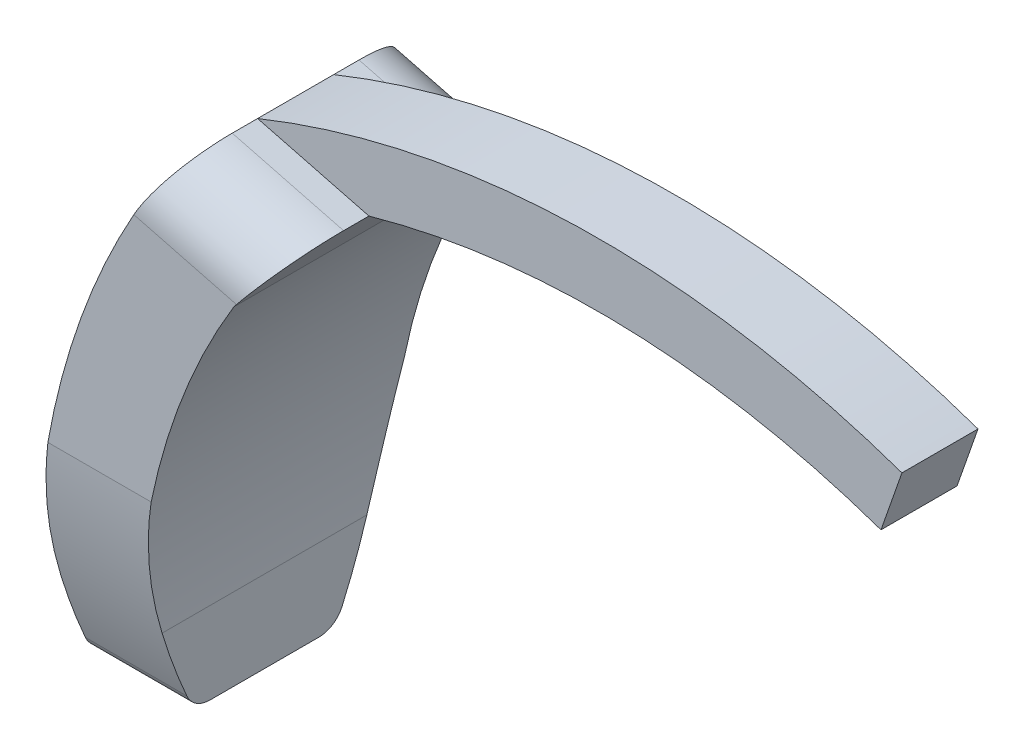
ISO-10303-21;
HEADER;
FILE_DESCRIPTION(('STEP AP214'),'2;1');
FILE_NAME('part.step','',(''),(''),'','','');
FILE_SCHEMA(('AUTOMOTIVE_DESIGN { 1 0 10303 214 1 1 1 1 }'));
ENDSEC;
DATA;
#1=APPLICATION_CONTEXT('core data for automotive mechanical design processes');
#2=APPLICATION_PROTOCOL_DEFINITION('international standard','automotive_design',2000,#1);
#3=PRODUCT_CONTEXT('',#1,'mechanical');
#4=PRODUCT('Part','Part','',(#3));
#5=PRODUCT_RELATED_PRODUCT_CATEGORY('part','',(#4));
#6=PRODUCT_DEFINITION_FORMATION('','',#4);
#7=PRODUCT_DEFINITION_CONTEXT('part definition',#1,'design');
#8=PRODUCT_DEFINITION('design','',#6,#7);
#9=PRODUCT_DEFINITION_SHAPE('','',#8);
#10=(LENGTH_UNIT() NAMED_UNIT(*) SI_UNIT(.MILLI.,.METRE.));
#11=(NAMED_UNIT(*) PLANE_ANGLE_UNIT() SI_UNIT($,.RADIAN.));
#12=(NAMED_UNIT(*) SI_UNIT($,.STERADIAN.) SOLID_ANGLE_UNIT());
#13=UNCERTAINTY_MEASURE_WITH_UNIT(LENGTH_MEASURE(1.E-05),#10,'distance_accuracy_value','');
#14=(GEOMETRIC_REPRESENTATION_CONTEXT(3) GLOBAL_UNCERTAINTY_ASSIGNED_CONTEXT((#13)) GLOBAL_UNIT_ASSIGNED_CONTEXT((#10,
#11,#12)) REPRESENTATION_CONTEXT('',''));
#15=CARTESIAN_POINT('',(0.,0.,0.));
#16=DIRECTION('',(0.,0.,1.));
#17=DIRECTION('',(1.,0.,0.));
#18=AXIS2_PLACEMENT_3D('',#15,#16,#17);
#19=CARTESIAN_POINT('',(37.4689413710405,-26.4802170261831,20.));
#20=DIRECTION('',(0.,0.,-1.));
#21=DIRECTION('',(-1.,0.,0.));
#22=AXIS2_PLACEMENT_3D('',#19,#20,#21);
#23=CYLINDRICAL_SURFACE('',#22,67.0432708850321);
#24=CARTESIAN_POINT('',(37.4689413710405,-26.4802170261831,7.));
#25=DIRECTION('',(0.,0.,1.));
#26=DIRECTION('',(-1.,0.,0.));
#27=AXIS2_PLACEMENT_3D('',#24,#25,#26);
#28=CIRCLE('',#27,67.0432708850321);
#29=CARTESIAN_POINT('',(59.6305427218619,36.7942928220257,7.));
#30=VERTEX_POINT('',#29);
#31=CARTESIAN_POINT('',(19.2412153442252,38.037611322694,7.));
#32=VERTEX_POINT('',#31);
#33=EDGE_CURVE('E178',#30,#32,#28,.T.);
#34=ORIENTED_EDGE('',*,*,#33,.F.);
#35=DIRECTION('',(0.,0.,-1.));
#36=VECTOR('',#35,1.);
#37=CARTESIAN_POINT('',(59.6305427218619,36.7942928220257,20.));
#38=LINE('',#37,#36);
#39=CARTESIAN_POINT('',(59.6305427218619,36.7942928220257,13.));
#40=VERTEX_POINT('',#39);
#41=EDGE_CURVE('E177',#40,#30,#38,.T.);
#42=ORIENTED_EDGE('',*,*,#41,.F.);
#43=CARTESIAN_POINT('',(37.4689413710405,-26.4802170261831,13.));
#44=DIRECTION('',(0.,0.,-1.));
#45=DIRECTION('',(1.,0.,0.));
#46=AXIS2_PLACEMENT_3D('',#43,#44,#45);
#47=CIRCLE('',#46,67.0432708850321);
#48=CARTESIAN_POINT('',(19.2412153442252,38.0376113226939,13.));
#49=VERTEX_POINT('',#48);
#50=EDGE_CURVE('E367',#49,#40,#47,.T.);
#51=ORIENTED_EDGE('',*,*,#50,.F.);
#52=DIRECTION('',(0.,0.,-1.));
#53=VECTOR('',#52,1.);
#54=CARTESIAN_POINT('',(19.2412153442252,38.037611322694,20.));
#55=LINE('',#54,#53);
#56=EDGE_CURVE('E186',#49,#32,#55,.T.);
#57=ORIENTED_EDGE('',*,*,#56,.T.);
#58=EDGE_LOOP('',(#34,#42,#51,#57));
#59=FACE_BOUND('',#58,.T.);
#60=ADVANCED_FACE('F39',(#59),#23,.F.);
#61=CARTESIAN_POINT('',(41.6359563842436,-14.5827991312985,20.));
#62=DIRECTION('',(0.943786140099188,-0.330556684634688,0.));
#63=DIRECTION('',(0.330556684634688,0.943786140099188,0.));
#64=AXIS2_PLACEMENT_3D('',#61,#62,#63);
#65=PLANE('',#64);
#66=ORIENTED_EDGE('',*,*,#41,.T.);
#67=DIRECTION('',(-0.330556684634688,-0.943786140099188,0.));
#68=VECTOR('',#67,1.);
#69=CARTESIAN_POINT('',(61.2833261450353,41.5132235225217,7.));
#70=LINE('',#69,#68);
#71=CARTESIAN_POINT('',(61.2833261450353,41.5132235225217,7.));
#72=VERTEX_POINT('',#71);
#73=EDGE_CURVE('E161',#72,#30,#70,.T.);
#74=ORIENTED_EDGE('',*,*,#73,.F.);
#75=DIRECTION('',(0.,0.,-1.));
#76=VECTOR('',#75,1.);
#77=CARTESIAN_POINT('',(61.2833261450353,41.5132235225217,20.));
#78=LINE('',#77,#76);
#79=CARTESIAN_POINT('',(61.2833261450353,41.5132235225217,13.));
#80=VERTEX_POINT('',#79);
#81=EDGE_CURVE('E175',#80,#72,#78,.T.);
#82=ORIENTED_EDGE('',*,*,#81,.F.);
#83=DIRECTION('',(0.330556684634688,0.943786140099188,0.));
#84=VECTOR('',#83,1.);
#85=CARTESIAN_POINT('',(61.2833261450353,41.5132235225217,13.));
#86=LINE('',#85,#84);
#87=EDGE_CURVE('E370',#40,#80,#86,.T.);
#88=ORIENTED_EDGE('',*,*,#87,.F.);
#89=EDGE_LOOP('',(#66,#74,#82,#88));
#90=FACE_BOUND('',#89,.T.);
#91=ADVANCED_FACE('F173',(#90),#65,.T.);
#92=CARTESIAN_POINT('',(37.4689413710405,-26.4802170261831,20.));
#93=DIRECTION('',(0.,0.,-1.));
#94=DIRECTION('',(-1.,0.,0.));
#95=AXIS2_PLACEMENT_3D('',#92,#93,#94);
#96=CYLINDRICAL_SURFACE('',#95,72.0432708850322);
#97=ORIENTED_EDGE('',*,*,#81,.T.);
#98=CARTESIAN_POINT('',(37.4689413710405,-26.4802170261831,7.));
#99=DIRECTION('',(0.,0.,-1.));
#100=DIRECTION('',(-1.,0.,0.));
#101=AXIS2_PLACEMENT_3D('',#98,#99,#100);
#102=CIRCLE('',#101,72.0432708850322);
#103=CARTESIAN_POINT('',(10.4603294324352,40.3087623114588,7.));
#104=VERTEX_POINT('',#103);
#105=EDGE_CURVE('E158',#104,#72,#102,.T.);
#106=ORIENTED_EDGE('',*,*,#105,.F.);
#107=DIRECTION('',(0.,0.,-1.));
#108=VECTOR('',#107,1.);
#109=CARTESIAN_POINT('',(10.4603294324352,40.3087623114588,20.));
#110=LINE('',#109,#108);
#111=CARTESIAN_POINT('',(10.4603294324352,40.3087623114588,13.));
#112=VERTEX_POINT('',#111);
#113=EDGE_CURVE('E188',#112,#104,#110,.T.);
#114=ORIENTED_EDGE('',*,*,#113,.F.);
#115=CARTESIAN_POINT('',(37.4689413710405,-26.4802170261831,13.));
#116=DIRECTION('',(0.,0.,1.));
#117=DIRECTION('',(1.,0.,0.));
#118=AXIS2_PLACEMENT_3D('',#115,#116,#117);
#119=CIRCLE('',#118,72.0432708850322);
#120=EDGE_CURVE('E183',#80,#112,#119,.T.);
#121=ORIENTED_EDGE('',*,*,#120,.F.);
#122=EDGE_LOOP('',(#97,#106,#114,#121));
#123=FACE_BOUND('',#122,.T.);
#124=ADVANCED_FACE('F181',(#123),#96,.T.);
#125=CARTESIAN_POINT('',(0.,0.,20.));
#126=DIRECTION('',(-1.,0.,0.));
#127=DIRECTION('',(0.,0.,1.));
#128=AXIS2_PLACEMENT_3D('',#125,#126,#127);
#129=PLANE('',#128);
#130=DIRECTION('',(0.,0.,-1.));
#131=VECTOR('',#130,1.);
#132=CARTESIAN_POINT('',(0.,0.,20.));
#133=LINE('',#132,#131);
#134=CARTESIAN_POINT('',(0.,0.,14.2938233166531));
#135=VERTEX_POINT('',#134);
#136=CARTESIAN_POINT('',(0.,0.,5.70617668334694));
#137=VERTEX_POINT('',#136);
#138=EDGE_CURVE('E328',#135,#137,#133,.T.);
#139=ORIENTED_EDGE('',*,*,#138,.F.);
#140=CARTESIAN_POINT('',(0.,2.,14.2938233166531));
#141=DIRECTION('',(-1.,0.,0.));
#142=DIRECTION('',(0.,0.,1.));
#143=AXIS2_PLACEMENT_3D('',#140,#141,#142);
#144=CIRCLE('',#143,2.);
#145=CARTESIAN_POINT('',(0.,1.19470921803027,16.1245354066537));
#146=VERTEX_POINT('',#145);
#147=EDGE_CURVE('E207',#135,#146,#144,.T.);
#148=ORIENTED_EDGE('',*,*,#147,.T.);
#149=CARTESIAN_POINT('',(0.,20.1636842433634,-26.9986850390799));
#150=DIRECTION('',(1.,0.,0.));
#151=DIRECTION('',(0.,0.,1.));
#152=AXIS2_PLACEMENT_3D('',#149,#150,#151);
#153=CIRCLE('',#152,47.1108708805415);
#154=CARTESIAN_POINT('',(0.,6.45878387635238,18.0746980273525));
#155=VERTEX_POINT('',#154);
#156=EDGE_CURVE('E310',#155,#146,#153,.T.);
#157=ORIENTED_EDGE('',*,*,#156,.F.);
#158=DIRECTION('',(0.,0.,-1.));
#159=VECTOR('',#158,1.);
#160=CARTESIAN_POINT('',(0.,6.45878387635238,20.));
#161=LINE('',#160,#159);
#162=CARTESIAN_POINT('',(0.,6.45878387635238,1.92530197264754));
#163=VERTEX_POINT('',#162);
#164=EDGE_CURVE('E320',#155,#163,#161,.T.);
#165=ORIENTED_EDGE('',*,*,#164,.T.);
#166=CARTESIAN_POINT('',(0.,20.1636842433635,46.9986850390799));
#167=DIRECTION('',(1.,0.,0.));
#168=DIRECTION('',(0.,0.,-1.));
#169=AXIS2_PLACEMENT_3D('',#166,#167,#168);
#170=CIRCLE('',#169,47.1108708805415);
#171=CARTESIAN_POINT('',(0.,1.19470921803027,3.87546459334628));
#172=VERTEX_POINT('',#171);
#173=EDGE_CURVE('E311',#172,#163,#170,.T.);
#174=ORIENTED_EDGE('',*,*,#173,.F.);
#175=CARTESIAN_POINT('',(0.,2.,5.70617668334694));
#176=DIRECTION('',(-1.,0.,0.));
#177=DIRECTION('',(0.,0.,1.));
#178=AXIS2_PLACEMENT_3D('',#175,#176,#177);
#179=CIRCLE('',#178,2.);
#180=EDGE_CURVE('E205',#172,#137,#179,.T.);
#181=ORIENTED_EDGE('',*,*,#180,.T.);
#182=EDGE_LOOP('',(#139,#148,#157,#165,#174,#181));
#183=FACE_BOUND('',#182,.T.);
#184=ADVANCED_FACE('F244',(#183),#129,.T.);
#185=CARTESIAN_POINT('',(8.,0.,20.));
#186=DIRECTION('',(-1.,0.,0.));
#187=DIRECTION('',(0.,0.,1.));
#188=AXIS2_PLACEMENT_3D('',#185,#186,#187);
#189=PLANE('',#188);
#190=CARTESIAN_POINT('',(8.,20.1636842433634,-26.9986850390799));
#191=DIRECTION('',(-1.,0.,0.));
#192=DIRECTION('',(0.,0.,1.));
#193=AXIS2_PLACEMENT_3D('',#190,#191,#192);
#194=CIRCLE('',#193,47.1108708805415);
#195=CARTESIAN_POINT('',(8.00000000000001,6.4587838763524,18.0746980273525));
#196=VERTEX_POINT('',#195);
#197=CARTESIAN_POINT('',(8.,1.19470921803027,16.1245354066537));
#198=VERTEX_POINT('',#197);
#199=EDGE_CURVE('E270',#196,#198,#194,.F.);
#200=ORIENTED_EDGE('',*,*,#199,.T.);
#201=CARTESIAN_POINT('',(8.,2.,14.2938233166531));
#202=DIRECTION('',(-1.,0.,0.));
#203=DIRECTION('',(0.,0.,1.));
#204=AXIS2_PLACEMENT_3D('',#201,#202,#203);
#205=CIRCLE('',#204,2.);
#206=CARTESIAN_POINT('',(8.,0.,14.2938233166531));
#207=VERTEX_POINT('',#206);
#208=EDGE_CURVE('E213',#198,#207,#205,.F.);
#209=ORIENTED_EDGE('',*,*,#208,.T.);
#210=DIRECTION('',(0.,0.,-1.));
#211=VECTOR('',#210,1.);
#212=CARTESIAN_POINT('',(8.,0.,20.));
#213=LINE('',#212,#211);
#214=CARTESIAN_POINT('',(8.,0.,5.70617668334694));
#215=VERTEX_POINT('',#214);
#216=EDGE_CURVE('E330',#207,#215,#213,.T.);
#217=ORIENTED_EDGE('',*,*,#216,.T.);
#218=CARTESIAN_POINT('',(8.,2.,5.70617668334694));
#219=DIRECTION('',(-1.,0.,0.));
#220=DIRECTION('',(0.,0.,1.));
#221=AXIS2_PLACEMENT_3D('',#218,#219,#220);
#222=CIRCLE('',#221,2.);
#223=CARTESIAN_POINT('',(8.,1.19470921803027,3.87546459334628));
#224=VERTEX_POINT('',#223);
#225=EDGE_CURVE('E211',#215,#224,#222,.F.);
#226=ORIENTED_EDGE('',*,*,#225,.T.);
#227=CARTESIAN_POINT('',(8.,20.1636842433635,46.9986850390799));
#228=DIRECTION('',(-1.,0.,0.));
#229=DIRECTION('',(0.,0.,1.));
#230=AXIS2_PLACEMENT_3D('',#227,#228,#229);
#231=CIRCLE('',#230,47.1108708805415);
#232=CARTESIAN_POINT('',(8.00000000000001,6.4587838763524,1.92530197264753));
#233=VERTEX_POINT('',#232);
#234=EDGE_CURVE('E309',#224,#233,#231,.F.);
#235=ORIENTED_EDGE('',*,*,#234,.T.);
#236=DIRECTION('',(0.,0.,-1.));
#237=VECTOR('',#236,1.);
#238=CARTESIAN_POINT('',(8.,6.45878387635238,20.));
#239=LINE('',#238,#237);
#240=EDGE_CURVE('E335',#196,#233,#239,.T.);
#241=ORIENTED_EDGE('',*,*,#240,.F.);
#242=EDGE_LOOP('',(#200,#209,#217,#226,#235,#241));
#243=FACE_BOUND('',#242,.T.);
#244=ADVANCED_FACE('F299',(#243),#189,.F.);
#245=CARTESIAN_POINT('',(-6.9296569979171,5.5889955317598,20.));
#246=DIRECTION('',(-0.778382165579646,0.627790732893964,0.));
#247=DIRECTION('',(-0.627790732893964,-0.778382165579646,0.));
#248=AXIS2_PLACEMENT_3D('',#245,#246,#247);
#249=PLANE('',#248);
#250=DIRECTION('',(0.627790732893964,0.778382165579646,0.));
#251=VECTOR('',#250,1.);
#252=CARTESIAN_POINT('',(-6.9296569979171,5.5889955317598,0.));
#253=LINE('',#252,#251);
#254=CARTESIAN_POINT('',(15.5921482682195,33.5132235225216,0.));
#255=VERTEX_POINT('',#254);
#256=CARTESIAN_POINT('',(15.7947945550856,33.7644796296171,0.));
#257=VERTEX_POINT('',#256);
#258=EDGE_CURVE('E269',#255,#257,#253,.T.);
#259=ORIENTED_EDGE('',*,*,#258,.T.);
#260=CARTESIAN_POINT('',(15.7947945550856,33.7644796296171,5.));
#261=DIRECTION('',(-0.778382165579646,0.627790732893964,0.));
#262=DIRECTION('',(-0.627790732893964,-0.778382165579646,0.));
#263=AXIS2_PLACEMENT_3D('',#260,#261,#262);
#264=ELLIPSE('',#263,5.48976053413914,5.);
#265=CARTESIAN_POINT('',(19.2412153442252,38.037611322694,5.));
#266=VERTEX_POINT('',#265);
#267=EDGE_CURVE('E11',#257,#266,#264,.F.);
#268=ORIENTED_EDGE('',*,*,#267,.T.);
#269=DIRECTION('',(0.,0.,-1.));
#270=VECTOR('',#269,1.);
#271=CARTESIAN_POINT('',(19.2412153442252,38.037611322694,7.));
#272=LINE('',#271,#270);
#273=EDGE_CURVE('E375',#32,#266,#272,.T.);
#274=ORIENTED_EDGE('',*,*,#273,.F.);
#275=ORIENTED_EDGE('',*,*,#56,.F.);
#276=CARTESIAN_POINT('',(19.2412153442252,38.037611322694,15.));
#277=VERTEX_POINT('',#276);
#278=EDGE_CURVE('E192',#277,#49,#55,.T.);
#279=ORIENTED_EDGE('',*,*,#278,.F.);
#280=CARTESIAN_POINT('',(15.7947945550856,33.7644796296171,15.));
#281=DIRECTION('',(-0.778382165579646,0.627790732893964,0.));
#282=DIRECTION('',(-0.627790732893964,-0.778382165579646,0.));
#283=AXIS2_PLACEMENT_3D('',#280,#281,#282);
#284=ELLIPSE('',#283,5.48976053413914,5.);
#285=CARTESIAN_POINT('',(15.7947945550856,33.7644796296171,20.));
#286=VERTEX_POINT('',#285);
#287=EDGE_CURVE('E221',#277,#286,#284,.F.);
#288=ORIENTED_EDGE('',*,*,#287,.T.);
#289=DIRECTION('',(0.627790732893964,0.778382165579646,0.));
#290=VECTOR('',#289,1.);
#291=CARTESIAN_POINT('',(-6.9296569979171,5.5889955317598,20.));
#292=LINE('',#291,#290);
#293=CARTESIAN_POINT('',(15.5921482682195,33.5132235225216,20.));
#294=VERTEX_POINT('',#293);
#295=EDGE_CURVE('E271',#294,#286,#292,.T.);
#296=ORIENTED_EDGE('',*,*,#295,.F.);
#297=DIRECTION('',(0.,0.,-1.));
#298=VECTOR('',#297,1.);
#299=CARTESIAN_POINT('',(15.5921482682195,33.5132235225216,20.));
#300=LINE('',#299,#298);
#301=EDGE_CURVE('E338',#294,#255,#300,.T.);
#302=ORIENTED_EDGE('',*,*,#301,.T.);
#303=EDGE_LOOP('',(#259,#268,#274,#275,#279,#288,#296,#302));
#304=FACE_BOUND('',#303,.T.);
#305=ADVANCED_FACE('F243',(#304),#249,.F.);
#306=CARTESIAN_POINT('',(60.,6.45878387635263,20.));
#307=DIRECTION('',(0.,0.,-1.));
#308=DIRECTION('',(-1.,0.,0.));
#309=AXIS2_PLACEMENT_3D('',#306,#307,#308);
#310=CYLINDRICAL_SURFACE('',#309,60.);
#311=DIRECTION('',(0.,0.,-1.));
#312=VECTOR('',#311,1.);
#313=CARTESIAN_POINT('',(10.4603294324352,40.3087623114588,7.));
#314=LINE('',#313,#312);
#315=CARTESIAN_POINT('',(10.4603294324352,40.3087623114588,5.));
#316=VERTEX_POINT('',#315);
#317=EDGE_CURVE('E371',#104,#316,#314,.T.);
#318=ORIENTED_EDGE('',*,*,#317,.T.);
#319=CARTESIAN_POINT('',(10.4603294324352,40.3087623114588,5.));
#320=CARTESIAN_POINT('',(10.4603445998212,40.3087782196875,4.86495757137411));
#321=CARTESIAN_POINT('',(10.4570487142382,40.303960774924,4.7299212038227));
#322=CARTESIAN_POINT('',(10.4439459578353,40.2847761937019,4.46087208782969));
#323=CARTESIAN_POINT('',(10.4341403652017,40.2704109319641,4.32685914366215));
#324=CARTESIAN_POINT('',(10.4081627643769,40.2322968407437,4.06115752563092));
#325=CARTESIAN_POINT('',(10.3920072345433,40.2085722984106,3.92946375031475));
#326=CARTESIAN_POINT('',(10.3535378666817,40.1519578948591,3.66897817575589));
#327=CARTESIAN_POINT('',(10.3312239204178,40.1190678725546,3.54018642756021));
#328=CARTESIAN_POINT('',(10.2807212210798,40.044425789814,3.28644894584309));
#329=CARTESIAN_POINT('',(10.252535190227,40.0026778356336,3.16150146086802));
#330=CARTESIAN_POINT('',(10.190601308443,39.9106429897794,2.91616334020923));
#331=CARTESIAN_POINT('',(10.1568513964505,39.860352933594,2.79577441357802));
#332=CARTESIAN_POINT('',(10.084174746187,39.751645882929,2.56035760498551));
#333=CARTESIAN_POINT('',(10.0452482212881,39.693229223411,2.44532950232299));
#334=CARTESIAN_POINT('',(9.96261417540492,39.5686858207052,2.2212690144221));
#335=CARTESIAN_POINT('',(9.91890484456033,39.5025561582137,2.11223892250562));
#336=CARTESIAN_POINT('',(9.82585131603659,39.3610962980851,1.8978410517902));
#337=CARTESIAN_POINT('',(9.77638289296061,39.2855590935305,1.79266350794159));
#338=CARTESIAN_POINT('',(9.67334701201393,39.127376310896,1.58991698964765));
#339=CARTESIAN_POINT('',(9.61977805556272,39.0447281326588,1.49235082341161));
#340=CARTESIAN_POINT('',(9.45366842434671,38.7869451019204,1.21192172325458));
#341=CARTESIAN_POINT('',(9.33565980838804,38.6018732291354,1.04117951132542));
#342=CARTESIAN_POINT('',(9.08264640652571,38.1996490003785,0.727808661168538));
#343=CARTESIAN_POINT('',(8.94706937482613,37.981308030835,0.587180497672956));
#344=CARTESIAN_POINT('',(8.66888515302981,37.5262527954047,0.349337357806755));
#345=CARTESIAN_POINT('',(8.52627928812825,37.2895419881142,0.252114232482172));
#346=CARTESIAN_POINT('',(8.26833645234535,36.8542623490092,0.118920702881748));
#347=CARTESIAN_POINT('',(8.15348744073729,36.6579825749621,0.0744223802878542));
#348=CARTESIAN_POINT('',(7.98159930736684,36.3602746072848,0.0298296197724729));
#349=CARTESIAN_POINT('',(7.92438262886311,36.2605174802787,0.0186578483386883));
#350=CARTESIAN_POINT('',(7.81027743434646,36.0602394787038,0.00374208086389099));
#351=CARTESIAN_POINT('',(7.75338897915929,35.9597184700958,-5.79889697235349E-07));
#352=CARTESIAN_POINT('',(7.69677995737001,35.8590079090404,0.));
#353=B_SPLINE_CURVE_WITH_KNOTS('',3,(#319,#320,#321,#322,#323,#324,#325,#326,#327,#328,#329,
#330,#331,#332,#333,#334,#335,#336,#337,#338,#339,#340,#341,#342,#343,#344,#345,#346,#347,#348,
#349,#350,#351,#352),.UNSPECIFIED.,.F.,.F.,(4,2,2,2,2,2,2,2,2,2,2,2,2,2,2,2,4),(0.,
0.404991915471956,0.809904333967831,1.21377285232145,1.61764846923163,2.02133726969629,
2.42517594840883,2.82899798666431,3.23297336704454,3.6483512517675,4.06388167194553,
4.89437936048958,5.76944631197044,6.64434890736727,7.33753990425988,7.68395156327089,
8.03042547970179),.UNSPECIFIED.);
#354=CARTESIAN_POINT('',(7.69677995737001,35.8590079090404,0.));
#355=VERTEX_POINT('',#354);
#356=EDGE_CURVE('E62',#316,#355,#353,.T.);
#357=ORIENTED_EDGE('',*,*,#356,.T.);
#358=CARTESIAN_POINT('',(60.,6.45878387635263,0.));
#359=DIRECTION('',(0.,0.,1.));
#360=DIRECTION('',(1.,0.,0.));
#361=AXIS2_PLACEMENT_3D('',#358,#359,#360);
#362=CIRCLE('',#361,60.);
#363=CARTESIAN_POINT('',(0.918024685161334,16.914413598985,0.));
#364=VERTEX_POINT('',#363);
#365=EDGE_CURVE('E321',#355,#364,#362,.T.);
#366=ORIENTED_EDGE('',*,*,#365,.T.);
#367=CARTESIAN_POINT('',(0.918024685161334,16.914413598985,0.));
#368=CARTESIAN_POINT('',(0.840255060275895,16.4749781622404,0.030377695300604));
#369=CARTESIAN_POINT('',(0.767475504660092,16.0351246393843,0.0669833507821966));
#370=CARTESIAN_POINT('',(0.631892217911945,15.1551009220275,0.15272819585631));
#371=CARTESIAN_POINT('',(0.569088513326063,14.7149307266873,0.201867418800654));
#372=CARTESIAN_POINT('',(0.396240135044911,13.3993315820688,0.367621544043428));
#373=CARTESIAN_POINT('',(0.300945254734914,12.5242061110229,0.502889762155534));
#374=CARTESIAN_POINT('',(0.149387748907843,10.7797527887144,0.82334054462956));
#375=CARTESIAN_POINT('',(0.0931246795628952,9.91042487163963,1.0085225413923));
#376=CARTESIAN_POINT('',(0.0370760638841769,8.61212876235278,1.32379471859797));
#377=CARTESIAN_POINT('',(0.0231184768566493,8.17919026722277,1.43547623928244));
#378=CARTESIAN_POINT('',(0.00457910103329028,7.3164875562469,1.67116956353693));
#379=CARTESIAN_POINT('',(-2.84511534188695E-06,6.88672328724813,1.79518116013281));
#380=CARTESIAN_POINT('',(0.,6.45878387635236,1.92530197264754));
#381=B_SPLINE_CURVE_WITH_KNOTS('',3,(#367,#368,#369,#370,#371,#372,#373,#374,#375,#376,#377,
#378,#379,#380),.UNSPECIFIED.,.F.,.F.,(4,2,2,2,2,2,4),(0.,1.34175037124948,2.68350431293408,
5.3529756985889,8.02241672938191,9.36415942494602,10.7058796016546),.UNSPECIFIED.);
#382=EDGE_CURVE('E250',#364,#163,#381,.T.);
#383=ORIENTED_EDGE('',*,*,#382,.T.);
#384=ORIENTED_EDGE('',*,*,#164,.F.);
#385=CARTESIAN_POINT('',(0.,6.45878387635236,18.0746980273525));
#386=CARTESIAN_POINT('',(-2.84511534116452E-06,6.88672328724813,18.2048188398672));
#387=CARTESIAN_POINT('',(0.00457910103329138,7.31648755624689,18.3288304364631));
#388=CARTESIAN_POINT('',(0.0231184768566508,8.17919026722276,18.5645237607176));
#389=CARTESIAN_POINT('',(0.0370760638841785,8.61212876235277,18.676205281402));
#390=CARTESIAN_POINT('',(0.0931246795628967,9.91042487163961,18.9914774586077));
#391=CARTESIAN_POINT('',(0.149387748907844,10.7797527887144,19.1766594553704));
#392=CARTESIAN_POINT('',(0.300945254734912,12.5242061110228,19.4971102378445));
#393=CARTESIAN_POINT('',(0.396240135044907,13.3993315820687,19.6323784559566));
#394=CARTESIAN_POINT('',(0.569088513326056,14.7149307266872,19.7981325811993));
#395=CARTESIAN_POINT('',(0.631892217911937,15.1551009220274,19.8472718041437));
#396=CARTESIAN_POINT('',(0.767475504660081,16.0351246393842,19.9330166492178));
#397=CARTESIAN_POINT('',(0.840255060275882,16.4749781622404,19.9696223046994));
#398=CARTESIAN_POINT('',(0.918024685161319,16.914413598985,20.));
#399=B_SPLINE_CURVE_WITH_KNOTS('',3,(#385,#386,#387,#388,#389,#390,#391,#392,#393,#394,#395,
#396,#397,#398),.UNSPECIFIED.,.F.,.F.,(4,2,2,2,2,2,4),(0.,1.34172017670854,2.68346287227264,
5.35290390306563,8.02237528872045,9.36412923040504,10.7058796016545),.UNSPECIFIED.);
#400=CARTESIAN_POINT('',(0.918024685161327,16.914413598985,20.));
#401=VERTEX_POINT('',#400);
#402=EDGE_CURVE('E260',#155,#401,#399,.T.);
#403=ORIENTED_EDGE('',*,*,#402,.T.);
#404=CARTESIAN_POINT('',(60.,6.45878387635263,20.));
#405=DIRECTION('',(0.,0.,1.));
#406=DIRECTION('',(1.,0.,0.));
#407=AXIS2_PLACEMENT_3D('',#404,#405,#406);
#408=CIRCLE('',#407,60.);
#409=CARTESIAN_POINT('',(7.69677995737001,35.8590079090404,20.));
#410=VERTEX_POINT('',#409);
#411=EDGE_CURVE('E347',#410,#401,#408,.T.);
#412=ORIENTED_EDGE('',*,*,#411,.F.);
#413=CARTESIAN_POINT('',(7.69677995737002,35.8590079090404,20.));
#414=CARTESIAN_POINT('',(7.77081530243654,35.9907289959482,20.0000122223199));
#415=CARTESIAN_POINT('',(7.84535425252816,36.1221582278871,19.9936003017493));
#416=CARTESIAN_POINT('',(7.99487403797245,36.3835120072653,19.9680967782982));
#417=CARTESIAN_POINT('',(8.06985483260224,36.5134366901982,19.949006326372));
#418=CARTESIAN_POINT('',(8.21968625772511,36.7708496474946,19.8983211749047));
#419=CARTESIAN_POINT('',(8.29453691806058,36.8983385745554,19.866729875849));
#420=CARTESIAN_POINT('',(8.44355031883548,37.1500509663868,19.7912898092601));
#421=CARTESIAN_POINT('',(8.51771305445718,37.2742744082996,19.7474409559509));
#422=CARTESIAN_POINT('',(8.66476458568018,37.5186284609157,19.6477808855076));
#423=CARTESIAN_POINT('',(8.73765325229793,37.6387586583847,19.5919684647112));
#424=CARTESIAN_POINT('',(8.88156751261972,37.874144729022,19.4687186713698));
#425=CARTESIAN_POINT('',(8.95259240821085,37.9893987853581,19.4012770124999));
#426=CARTESIAN_POINT('',(9.09209443923044,38.2141399259426,19.2552339731469));
#427=CARTESIAN_POINT('',(9.16057280446923,38.3236298048235,19.1766380701484));
#428=CARTESIAN_POINT('',(9.29440767244893,38.5361697674005,19.0087090245071));
#429=CARTESIAN_POINT('',(9.35976310827075,38.6392176539058,18.9193722484833));
#430=CARTESIAN_POINT('',(9.48635549415256,38.8375653863507,18.7310163623249));
#431=CARTESIAN_POINT('',(9.54761199024316,38.9329025359597,18.632049698773));
#432=CARTESIAN_POINT('',(9.6657344969587,39.1156906477469,18.4246666137749));
#433=CARTESIAN_POINT('',(9.72260070089813,39.2031419571852,18.3162506088525));
#434=CARTESIAN_POINT('',(9.83132866198454,39.3694857193176,18.0906290170421));
#435=CARTESIAN_POINT('',(9.88318889355431,39.4483755637977,17.9734207699237));
#436=CARTESIAN_POINT('',(9.98124499791076,39.5968596218718,17.7310888027432));
#437=CARTESIAN_POINT('',(10.0274433575035,39.6664579177061,17.6059685946434));
#438=CARTESIAN_POINT('',(10.1118811943629,39.7931680274261,17.3538344871025));
#439=CARTESIAN_POINT('',(10.1503656625546,39.8506688409051,17.2270980760591));
#440=CARTESIAN_POINT('',(10.2210990727083,39.9560232968974,16.9680647521764));
#441=CARTESIAN_POINT('',(10.2533508627292,40.0038813461566,16.8357704128704));
#442=CARTESIAN_POINT('',(10.3111848047098,40.0894888428302,16.5666772324342));
#443=CARTESIAN_POINT('',(10.3367733778077,40.1272480231739,16.4298828721299));
#444=CARTESIAN_POINT('',(10.3809601753398,40.1923343076495,16.152786063508));
#445=CARTESIAN_POINT('',(10.3995612260632,40.2196656296763,16.0124850580897));
#446=CARTESIAN_POINT('',(10.4297322175692,40.2639510126163,15.7273848199493));
#447=CARTESIAN_POINT('',(10.441195662576,40.2807479216846,15.58254982625));
#448=CARTESIAN_POINT('',(10.4564996272704,40.3031571158489,15.2918114002364));
#449=CARTESIAN_POINT('',(10.4603501654901,40.3087841005265,15.1459096260838));
#450=CARTESIAN_POINT('',(10.4603294324352,40.3087623114588,15.));
#451=B_SPLINE_CURVE_WITH_KNOTS('',3,(#413,#414,#415,#416,#417,#418,#419,#420,#421,#422,#423,
#424,#425,#426,#427,#428,#429,#430,#431,#432,#433,#434,#435,#436,#437,#438,#439,#440,#441,#442,
#443,#444,#445,#446,#447,#448,#449,#450),.UNSPECIFIED.,.F.,.F.,(4,2,2,2,2,2,2,2,2,2,2,2,2,2,2,2,
2,2,4),(0.,0.453156724908615,0.906272317962791,1.3592647389662,1.81226033000256,
2.26530151862636,2.71851004829568,3.17149678724764,3.62463719423184,4.07543482080602,
4.52621258640715,4.97712729630968,5.42784324032697,5.86047199631319,6.29290259014736,
6.72491490863355,7.15675229961618,7.5948874790581,8.032445690866),.UNSPECIFIED.);
#452=CARTESIAN_POINT('',(10.4603294324352,40.3087623114588,15.));
#453=VERTEX_POINT('',#452);
#454=EDGE_CURVE('E225',#410,#453,#451,.T.);
#455=ORIENTED_EDGE('',*,*,#454,.T.);
#456=EDGE_CURVE('E184',#453,#112,#110,.T.);
#457=ORIENTED_EDGE('',*,*,#456,.T.);
#458=ORIENTED_EDGE('',*,*,#113,.T.);
#459=EDGE_LOOP('',(#318,#357,#366,#383,#384,#403,#412,#455,#457,#458));
#460=FACE_BOUND('',#459,.T.);
#461=ADVANCED_FACE('F237',(#460),#310,.T.);
#462=CARTESIAN_POINT('',(0.,0.,20.));
#463=DIRECTION('',(0.,1.,0.));
#464=DIRECTION('',(0.,0.,1.));
#465=AXIS2_PLACEMENT_3D('',#462,#463,#464);
#466=PLANE('',#465);
#467=ORIENTED_EDGE('',*,*,#216,.F.);
#468=DIRECTION('',(-1.,0.,0.));
#469=VECTOR('',#468,1.);
#470=CARTESIAN_POINT('',(0.,0.,14.2938233166531));
#471=LINE('',#470,#469);
#472=EDGE_CURVE('E202',#207,#135,#471,.T.);
#473=ORIENTED_EDGE('',*,*,#472,.T.);
#474=ORIENTED_EDGE('',*,*,#138,.T.);
#475=DIRECTION('',(-1.,0.,0.));
#476=VECTOR('',#475,1.);
#477=CARTESIAN_POINT('',(0.,0.,5.70617668334694));
#478=LINE('',#477,#476);
#479=EDGE_CURVE('E200',#137,#215,#478,.F.);
#480=ORIENTED_EDGE('',*,*,#479,.T.);
#481=EDGE_LOOP('',(#467,#473,#474,#480));
#482=FACE_BOUND('',#481,.T.);
#483=ADVANCED_FACE('F242',(#482),#466,.F.);
#484=CARTESIAN_POINT('',(60.,6.45878387635263,20.));
#485=DIRECTION('',(0.,0.,-1.));
#486=DIRECTION('',(-1.,0.,0.));
#487=AXIS2_PLACEMENT_3D('',#484,#485,#486);
#488=CYLINDRICAL_SURFACE('',#487,52.);
#489=CARTESIAN_POINT('',(8.00000000000001,6.4587838763524,18.0746980273525));
#490=CARTESIAN_POINT('',(7.99999670018985,6.88757601345745,18.2050789550254));
#491=CARTESIAN_POINT('',(8.00530473246985,7.31819798619936,18.3293237502157));
#492=CARTESIAN_POINT('',(8.02678150059162,8.1825668069258,18.5654200733919));
#493=CARTESIAN_POINT('',(8.04295048245074,8.61631372547503,18.6772713205778));
#494=CARTESIAN_POINT('',(8.1078498725146,9.91628850822193,18.992801596996));
#495=CARTESIAN_POINT('',(8.17296785296353,10.786311925667,19.1779942915785));
#496=CARTESIAN_POINT('',(8.34831844008648,12.5310543613196,19.4982372957678));
#497=CARTESIAN_POINT('',(8.45855173099638,13.4057734505448,19.6332868448254));
#498=CARTESIAN_POINT('',(8.65844737423739,14.7197162839589,19.7986863843312));
#499=CARTESIAN_POINT('',(8.73110120318003,15.159299856179,19.8477123847838));
#500=CARTESIAN_POINT('',(8.88791967992399,16.0376309889704,19.933229149953));
#501=CARTESIAN_POINT('',(8.97208428475702,16.4763785526563,19.9697199614601));
#502=CARTESIAN_POINT('',(9.06200036217357,16.914413598985,20.));
#503=B_SPLINE_CURVE_WITH_KNOTS('',3,(#489,#490,#491,#492,#493,#494,#495,#496,#497,#498,#499,
#500,#501,#502),.UNSPECIFIED.,.F.,.F.,(4,2,2,2,2,2,4),(0.,1.34437952162072,2.68878949654913,
5.36178095381603,8.03481295218575,9.37923798207002,10.7236579935202),.UNSPECIFIED.);
#504=CARTESIAN_POINT('',(9.06200036217357,16.914413598985,20.));
#505=VERTEX_POINT('',#504);
#506=EDGE_CURVE('E285',#196,#505,#503,.T.);
#507=ORIENTED_EDGE('',*,*,#506,.F.);
#508=ORIENTED_EDGE('',*,*,#240,.T.);
#509=CARTESIAN_POINT('',(9.06200036217357,16.914413598985,0.));
#510=CARTESIAN_POINT('',(8.97208428475703,16.4763785526563,0.0302800385399477));
#511=CARTESIAN_POINT('',(8.887919679924,16.0376309889705,0.0667708500469962));
#512=CARTESIAN_POINT('',(8.73110120318004,15.1592998561791,0.152287615216177));
#513=CARTESIAN_POINT('',(8.6584473742374,14.719716283959,0.201313615668822));
#514=CARTESIAN_POINT('',(8.45855173099637,13.4057734505449,0.366713155174588));
#515=CARTESIAN_POINT('',(8.34831844008647,12.5310543613196,0.501762704232202));
#516=CARTESIAN_POINT('',(8.17296785296352,10.7863119256671,0.822005708421512));
#517=CARTESIAN_POINT('',(8.1078498725146,9.91628850822195,1.00719840300403));
#518=CARTESIAN_POINT('',(8.04295048245074,8.61631372547505,1.32272867942218));
#519=CARTESIAN_POINT('',(8.02678150059162,8.18256680692582,1.43457992660811));
#520=CARTESIAN_POINT('',(8.00530473246985,7.31819798619937,1.6706762497843));
#521=CARTESIAN_POINT('',(7.99999670018985,6.88757601345745,1.79492104497461));
#522=CARTESIAN_POINT('',(8.,6.4587838763524,1.92530197264753));
#523=B_SPLINE_CURVE_WITH_KNOTS('',3,(#509,#510,#511,#512,#513,#514,#515,#516,#517,#518,#519,
#520,#521,#522),.UNSPECIFIED.,.F.,.F.,(4,2,2,2,2,2,4),(0.,1.34442001145019,2.68884504133448,
5.36187703970421,8.03486849697113,9.37927847189953,10.7236579935203),.UNSPECIFIED.);
#524=CARTESIAN_POINT('',(9.06200036217357,16.914413598985,0.));
#525=VERTEX_POINT('',#524);
#526=EDGE_CURVE('E302',#525,#233,#523,.T.);
#527=ORIENTED_EDGE('',*,*,#526,.F.);
#528=CARTESIAN_POINT('',(60.,6.45878387635263,0.));
#529=DIRECTION('',(0.,0.,1.));
#530=DIRECTION('',(1.,0.,0.));
#531=AXIS2_PLACEMENT_3D('',#528,#529,#530);
#532=CIRCLE('',#531,52.);
#533=EDGE_CURVE('E341',#255,#525,#532,.T.);
#534=ORIENTED_EDGE('',*,*,#533,.F.);
#535=ORIENTED_EDGE('',*,*,#301,.F.);
#536=CARTESIAN_POINT('',(60.,6.45878387635263,20.));
#537=DIRECTION('',(0.,0.,1.));
#538=DIRECTION('',(1.,0.,0.));
#539=AXIS2_PLACEMENT_3D('',#536,#537,#538);
#540=CIRCLE('',#539,52.);
#541=EDGE_CURVE('E340',#294,#505,#540,.T.);
#542=ORIENTED_EDGE('',*,*,#541,.T.);
#543=EDGE_LOOP('',(#507,#508,#527,#534,#535,#542));
#544=FACE_BOUND('',#543,.T.);
#545=ADVANCED_FACE('F291',(#544),#488,.F.);
#546=CARTESIAN_POINT('',(0.,0.,20.));
#547=DIRECTION('',(0.,0.,1.));
#548=DIRECTION('',(1.,0.,0.));
#549=AXIS2_PLACEMENT_3D('',#546,#547,#548);
#550=PLANE('',#549);
#551=ORIENTED_EDGE('',*,*,#295,.T.);
#552=DIRECTION('',(0.968140704872082,-0.250406820134333,0.));
#553=VECTOR('',#552,1.);
#554=CARTESIAN_POINT('',(9.20829533176352,35.4680587870984,20.));
#555=LINE('',#554,#553);
#556=EDGE_CURVE('E223',#286,#410,#555,.F.);
#557=ORIENTED_EDGE('',*,*,#556,.T.);
#558=ORIENTED_EDGE('',*,*,#411,.T.);
#559=DIRECTION('',(-1.,0.,0.));
#560=VECTOR('',#559,1.);
#561=CARTESIAN_POINT('',(15.,16.914413598985,20.));
#562=LINE('',#561,#560);
#563=EDGE_CURVE('E197',#505,#401,#562,.T.);
#564=ORIENTED_EDGE('',*,*,#563,.F.);
#565=ORIENTED_EDGE('',*,*,#541,.F.);
#566=EDGE_LOOP('',(#551,#557,#558,#564,#565));
#567=FACE_BOUND('',#566,.T.);
#568=ADVANCED_FACE('F296',(#567),#550,.T.);
#569=CARTESIAN_POINT('',(0.,0.,0.));
#570=DIRECTION('',(0.,0.,1.));
#571=DIRECTION('',(1.,0.,0.));
#572=AXIS2_PLACEMENT_3D('',#569,#570,#571);
#573=PLANE('',#572);
#574=ORIENTED_EDGE('',*,*,#365,.F.);
#575=DIRECTION('',(-0.968140704872082,0.250406820134333,0.));
#576=VECTOR('',#575,1.);
#577=CARTESIAN_POINT('',(9.17588031968439,35.4764428371218,0.));
#578=LINE('',#577,#576);
#579=EDGE_CURVE('E48',#355,#257,#578,.F.);
#580=ORIENTED_EDGE('',*,*,#579,.T.);
#581=ORIENTED_EDGE('',*,*,#258,.F.);
#582=ORIENTED_EDGE('',*,*,#533,.T.);
#583=DIRECTION('',(-1.,0.,0.));
#584=VECTOR('',#583,1.);
#585=CARTESIAN_POINT('',(15.,16.914413598985,0.));
#586=LINE('',#585,#584);
#587=EDGE_CURVE('E194',#525,#364,#586,.T.);
#588=ORIENTED_EDGE('',*,*,#587,.T.);
#589=EDGE_LOOP('',(#574,#580,#581,#582,#588));
#590=FACE_BOUND('',#589,.T.);
#591=ADVANCED_FACE('F298',(#590),#573,.F.);
#592=CARTESIAN_POINT('',(15.,20.1636842433635,46.9986850390799));
#593=DIRECTION('',(-1.,0.,0.));
#594=DIRECTION('',(0.,0.,1.));
#595=AXIS2_PLACEMENT_3D('',#592,#593,#594);
#596=CYLINDRICAL_SURFACE('',#595,47.1108708805415);
#597=ORIENTED_EDGE('',*,*,#234,.F.);
#598=DIRECTION('',(-1.,0.,0.));
#599=VECTOR('',#598,1.);
#600=CARTESIAN_POINT('',(15.,1.19470921803026,3.87546459334628));
#601=LINE('',#600,#599);
#602=EDGE_CURVE('E215',#224,#172,#601,.T.);
#603=ORIENTED_EDGE('',*,*,#602,.T.);
#604=ORIENTED_EDGE('',*,*,#173,.T.);
#605=ORIENTED_EDGE('',*,*,#382,.F.);
#606=ORIENTED_EDGE('',*,*,#587,.F.);
#607=ORIENTED_EDGE('',*,*,#526,.T.);
#608=EDGE_LOOP('',(#597,#603,#604,#605,#606,#607));
#609=FACE_BOUND('',#608,.T.);
#610=ADVANCED_FACE('F278',(#609),#596,.T.);
#611=CARTESIAN_POINT('',(15.,20.1636842433634,-26.9986850390799));
#612=DIRECTION('',(-1.,0.,0.));
#613=DIRECTION('',(0.,0.,1.));
#614=AXIS2_PLACEMENT_3D('',#611,#612,#613);
#615=CYLINDRICAL_SURFACE('',#614,47.1108708805415);
#616=ORIENTED_EDGE('',*,*,#156,.T.);
#617=DIRECTION('',(-1.,0.,0.));
#618=VECTOR('',#617,1.);
#619=CARTESIAN_POINT('',(15.,1.19470921803027,16.1245354066537));
#620=LINE('',#619,#618);
#621=EDGE_CURVE('E209',#146,#198,#620,.F.);
#622=ORIENTED_EDGE('',*,*,#621,.T.);
#623=ORIENTED_EDGE('',*,*,#199,.F.);
#624=ORIENTED_EDGE('',*,*,#506,.T.);
#625=ORIENTED_EDGE('',*,*,#563,.T.);
#626=ORIENTED_EDGE('',*,*,#402,.F.);
#627=EDGE_LOOP('',(#616,#622,#623,#624,#625,#626));
#628=FACE_BOUND('',#627,.T.);
#629=ADVANCED_FACE('F273',(#628),#615,.T.);
#630=CARTESIAN_POINT('',(15.,2.,14.2938233166531));
#631=DIRECTION('',(-1.,0.,0.));
#632=DIRECTION('',(0.,0.,1.));
#633=AXIS2_PLACEMENT_3D('',#630,#631,#632);
#634=CYLINDRICAL_SURFACE('',#633,2.);
#635=ORIENTED_EDGE('',*,*,#208,.F.);
#636=ORIENTED_EDGE('',*,*,#621,.F.);
#637=ORIENTED_EDGE('',*,*,#147,.F.);
#638=ORIENTED_EDGE('',*,*,#472,.F.);
#639=EDGE_LOOP('',(#635,#636,#637,#638));
#640=FACE_BOUND('',#639,.T.);
#641=ADVANCED_FACE('F277',(#640),#634,.T.);
#642=CARTESIAN_POINT('',(15.,2.,5.70617668334694));
#643=DIRECTION('',(-1.,0.,0.));
#644=DIRECTION('',(0.,0.,1.));
#645=AXIS2_PLACEMENT_3D('',#642,#643,#644);
#646=CYLINDRICAL_SURFACE('',#645,2.);
#647=ORIENTED_EDGE('',*,*,#225,.F.);
#648=ORIENTED_EDGE('',*,*,#479,.F.);
#649=ORIENTED_EDGE('',*,*,#180,.F.);
#650=ORIENTED_EDGE('',*,*,#602,.F.);
#651=EDGE_LOOP('',(#647,#648,#649,#650));
#652=FACE_BOUND('',#651,.T.);
#653=ADVANCED_FACE('F387',(#652),#646,.T.);
#654=CARTESIAN_POINT('',(10.4603294324352,40.3087623114588,13.));
#655=DIRECTION('',(-0.250406820134333,-0.968140704872082,0.));
#656=DIRECTION('',(0.968140704872082,-0.250406820134333,0.));
#657=AXIS2_PLACEMENT_3D('',#654,#655,#656);
#658=PLANE('',#657);
#659=ORIENTED_EDGE('',*,*,#456,.F.);
#660=DIRECTION('',(0.968140704872082,-0.250406820134333,0.));
#661=VECTOR('',#660,1.);
#662=CARTESIAN_POINT('',(19.2412153442252,38.037611322694,15.));
#663=LINE('',#662,#661);
#664=EDGE_CURVE('E218',#453,#277,#663,.T.);
#665=ORIENTED_EDGE('',*,*,#664,.T.);
#666=ORIENTED_EDGE('',*,*,#278,.T.);
#667=DIRECTION('',(0.968140704872082,-0.250406820134333,0.));
#668=VECTOR('',#667,1.);
#669=CARTESIAN_POINT('',(10.4603294324352,40.3087623114588,13.));
#670=LINE('',#669,#668);
#671=EDGE_CURVE('E364',#112,#49,#670,.T.);
#672=ORIENTED_EDGE('',*,*,#671,.F.);
#673=EDGE_LOOP('',(#659,#665,#666,#672));
#674=FACE_BOUND('',#673,.T.);
#675=ADVANCED_FACE('F280',(#674),#658,.F.);
#676=CARTESIAN_POINT('',(37.4689413710405,-26.4802170261831,13.));
#677=DIRECTION('',(0.,0.,1.));
#678=DIRECTION('',(1.,0.,0.));
#679=AXIS2_PLACEMENT_3D('',#676,#677,#678);
#680=PLANE('',#679);
#681=ORIENTED_EDGE('',*,*,#120,.T.);
#682=ORIENTED_EDGE('',*,*,#671,.T.);
#683=ORIENTED_EDGE('',*,*,#50,.T.);
#684=ORIENTED_EDGE('',*,*,#87,.T.);
#685=EDGE_LOOP('',(#681,#682,#683,#684));
#686=FACE_BOUND('',#685,.T.);
#687=ADVANCED_FACE('F369',(#686),#680,.T.);
#688=CARTESIAN_POINT('',(19.2412153442252,38.037611322694,7.));
#689=DIRECTION('',(-0.250406820134333,-0.968140704872082,0.));
#690=DIRECTION('',(0.968140704872082,-0.250406820134333,0.));
#691=AXIS2_PLACEMENT_3D('',#688,#689,#690);
#692=PLANE('',#691);
#693=ORIENTED_EDGE('',*,*,#273,.T.);
#694=DIRECTION('',(-0.968140704872082,0.250406820134333,0.));
#695=VECTOR('',#694,1.);
#696=CARTESIAN_POINT('',(19.2412153442252,38.037611322694,5.));
#697=LINE('',#696,#695);
#698=EDGE_CURVE('E232',#266,#316,#697,.T.);
#699=ORIENTED_EDGE('',*,*,#698,.T.);
#700=ORIENTED_EDGE('',*,*,#317,.F.);
#701=DIRECTION('',(-0.968140704872082,0.250406820134333,0.));
#702=VECTOR('',#701,1.);
#703=CARTESIAN_POINT('',(19.2412153442252,38.037611322694,7.));
#704=LINE('',#703,#702);
#705=EDGE_CURVE('E164',#32,#104,#704,.T.);
#706=ORIENTED_EDGE('',*,*,#705,.F.);
#707=EDGE_LOOP('',(#693,#699,#700,#706));
#708=FACE_BOUND('',#707,.T.);
#709=ADVANCED_FACE('F405',(#708),#692,.F.);
#710=CARTESIAN_POINT('',(37.4689413710405,-26.4802170261831,7.));
#711=DIRECTION('',(0.,0.,-1.));
#712=DIRECTION('',(-1.,0.,0.));
#713=AXIS2_PLACEMENT_3D('',#710,#711,#712);
#714=PLANE('',#713);
#715=ORIENTED_EDGE('',*,*,#105,.T.);
#716=ORIENTED_EDGE('',*,*,#73,.T.);
#717=ORIENTED_EDGE('',*,*,#33,.T.);
#718=ORIENTED_EDGE('',*,*,#705,.T.);
#719=EDGE_LOOP('',(#715,#716,#717,#718));
#720=FACE_BOUND('',#719,.T.);
#721=ADVANCED_FACE('F160',(#720),#714,.T.);
#722=CARTESIAN_POINT('',(9.20829533176352,35.4680587870984,15.));
#723=DIRECTION('',(-0.968140704872082,0.250406820134333,0.));
#724=DIRECTION('',(-0.250406820134333,-0.968140704872082,0.));
#725=AXIS2_PLACEMENT_3D('',#722,#723,#724);
#726=CYLINDRICAL_SURFACE('',#725,5.);
#727=ORIENTED_EDGE('',*,*,#454,.F.);
#728=ORIENTED_EDGE('',*,*,#556,.F.);
#729=ORIENTED_EDGE('',*,*,#287,.F.);
#730=ORIENTED_EDGE('',*,*,#664,.F.);
#731=EDGE_LOOP('',(#727,#728,#729,#730));
#732=FACE_BOUND('',#731,.T.);
#733=ADVANCED_FACE('F234',(#732),#726,.T.);
#734=CARTESIAN_POINT('',(17.9891812435535,33.1969077983335,5.));
#735=DIRECTION('',(-0.968140704872082,0.250406820134333,0.));
#736=DIRECTION('',(-0.250406820134333,-0.968140704872082,0.));
#737=AXIS2_PLACEMENT_3D('',#734,#735,#736);
#738=CYLINDRICAL_SURFACE('',#737,5.);
#739=ORIENTED_EDGE('',*,*,#267,.F.);
#740=ORIENTED_EDGE('',*,*,#579,.F.);
#741=ORIENTED_EDGE('',*,*,#356,.F.);
#742=ORIENTED_EDGE('',*,*,#698,.F.);
#743=EDGE_LOOP('',(#739,#740,#741,#742));
#744=FACE_BOUND('',#743,.T.);
#745=ADVANCED_FACE('F41',(#744),#738,.T.);
#746=CLOSED_SHELL('',(#60,#91,#124,#184,#244,#305,#461,#483,#545,#568,#591,#610,#629,#641,#653,
#675,#687,#709,#721,#733,#745));
#747=MANIFOLD_SOLID_BREP('B2',#746);
#748=ADVANCED_BREP_SHAPE_REPRESENTATION('',(#18,#747),#14);
#749=SHAPE_DEFINITION_REPRESENTATION(#9,#748);
ENDSEC;
END-ISO-10303-21;
